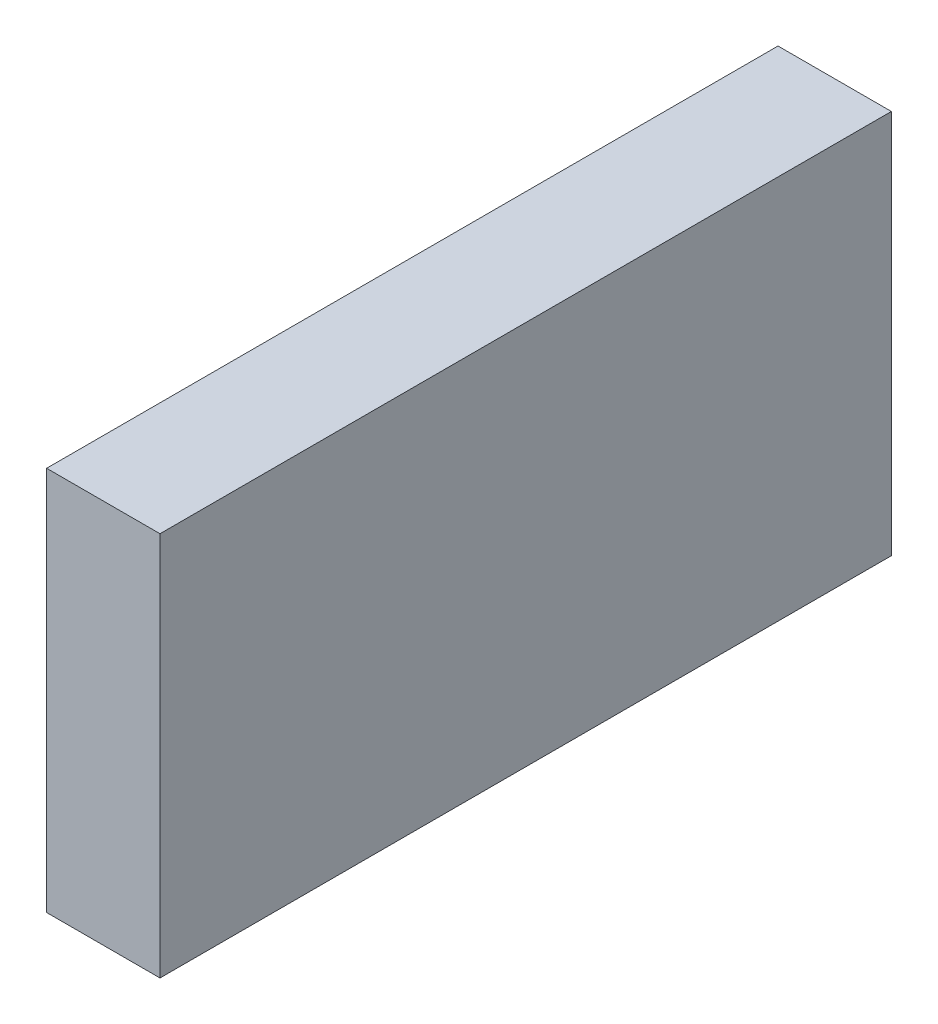
ISO-10303-21;
HEADER;
FILE_DESCRIPTION(('STEP AP214'),'2;1');
FILE_NAME('part.step','',(''),(''),'','','');
FILE_SCHEMA(('AUTOMOTIVE_DESIGN { 1 0 10303 214 1 1 1 1 }'));
ENDSEC;
DATA;
#1=APPLICATION_CONTEXT('core data for automotive mechanical design processes');
#2=APPLICATION_PROTOCOL_DEFINITION('international standard','automotive_design',2000,#1);
#3=PRODUCT_CONTEXT('',#1,'mechanical');
#4=PRODUCT('Part','Part','',(#3));
#5=PRODUCT_RELATED_PRODUCT_CATEGORY('part','',(#4));
#6=PRODUCT_DEFINITION_FORMATION('','',#4);
#7=PRODUCT_DEFINITION_CONTEXT('part definition',#1,'design');
#8=PRODUCT_DEFINITION('design','',#6,#7);
#9=PRODUCT_DEFINITION_SHAPE('','',#8);
#10=(LENGTH_UNIT() NAMED_UNIT(*) SI_UNIT(.MILLI.,.METRE.));
#11=(NAMED_UNIT(*) PLANE_ANGLE_UNIT() SI_UNIT($,.RADIAN.));
#12=(NAMED_UNIT(*) SI_UNIT($,.STERADIAN.) SOLID_ANGLE_UNIT());
#13=UNCERTAINTY_MEASURE_WITH_UNIT(LENGTH_MEASURE(1.E-05),#10,'distance_accuracy_value','');
#14=(GEOMETRIC_REPRESENTATION_CONTEXT(3) GLOBAL_UNCERTAINTY_ASSIGNED_CONTEXT((#13)) GLOBAL_UNIT_ASSIGNED_CONTEXT((#10,
#11,#12)) REPRESENTATION_CONTEXT('',''));
#15=CARTESIAN_POINT('',(0.,0.,0.));
#16=DIRECTION('',(0.,0.,1.));
#17=DIRECTION('',(1.,0.,0.));
#18=AXIS2_PLACEMENT_3D('',#15,#16,#17);
#19=CARTESIAN_POINT('',(140.338429329019,10.,-75.2974570796293));
#20=DIRECTION('',(0.,0.,1.));
#21=DIRECTION('',(1.,0.,0.));
#22=AXIS2_PLACEMENT_3D('',#19,#20,#21);
#23=PLANE('',#22);
#24=DIRECTION('',(-1.,0.,0.));
#25=VECTOR('',#24,1.);
#26=CARTESIAN_POINT('',(140.338429329019,0.,-75.2974570796293));
#27=LINE('',#26,#25);
#28=CARTESIAN_POINT('',(140.338429329019,0.,-75.2974570796293));
#29=VERTEX_POINT('',#28);
#30=CARTESIAN_POINT('',(137.391912192511,0.,-75.2974570796293));
#31=VERTEX_POINT('',#30);
#32=EDGE_CURVE('E93',#29,#31,#27,.T.);
#33=ORIENTED_EDGE('',*,*,#32,.T.);
#34=DIRECTION('',(0.,-1.,0.));
#35=VECTOR('',#34,1.);
#36=CARTESIAN_POINT('',(137.391912192511,10.,-75.2974570796293));
#37=LINE('',#36,#35);
#38=CARTESIAN_POINT('',(137.391912192511,10.,-75.2974570796293));
#39=VERTEX_POINT('',#38);
#40=EDGE_CURVE('E11',#39,#31,#37,.T.);
#41=ORIENTED_EDGE('',*,*,#40,.F.);
#42=DIRECTION('',(-1.,0.,0.));
#43=VECTOR('',#42,1.);
#44=CARTESIAN_POINT('',(140.338429329019,10.,-75.2974570796293));
#45=LINE('',#44,#43);
#46=CARTESIAN_POINT('',(140.338429329019,10.,-75.2974570796293));
#47=VERTEX_POINT('',#46);
#48=EDGE_CURVE('E81',#47,#39,#45,.T.);
#49=ORIENTED_EDGE('',*,*,#48,.F.);
#50=DIRECTION('',(0.,-1.,0.));
#51=VECTOR('',#50,1.);
#52=CARTESIAN_POINT('',(140.338429329019,10.,-75.2974570796293));
#53=LINE('',#52,#51);
#54=EDGE_CURVE('E89',#47,#29,#53,.T.);
#55=ORIENTED_EDGE('',*,*,#54,.T.);
#56=EDGE_LOOP('',(#33,#41,#49,#55));
#57=FACE_BOUND('',#56,.T.);
#58=ADVANCED_FACE('F30',(#57),#23,.F.);
#59=CARTESIAN_POINT('',(137.391912192511,10.,-75.2974570796293));
#60=DIRECTION('',(1.,0.,0.));
#61=DIRECTION('',(0.,0.,-1.));
#62=AXIS2_PLACEMENT_3D('',#59,#60,#61);
#63=PLANE('',#62);
#64=DIRECTION('',(0.,0.,1.));
#65=VECTOR('',#64,1.);
#66=CARTESIAN_POINT('',(137.391912192511,0.,-75.2974570796293));
#67=LINE('',#66,#65);
#68=CARTESIAN_POINT('',(137.391912192511,0.,-56.28859622837));
#69=VERTEX_POINT('',#68);
#70=EDGE_CURVE('E85',#31,#69,#67,.T.);
#71=ORIENTED_EDGE('',*,*,#70,.T.);
#72=DIRECTION('',(0.,-1.,0.));
#73=VECTOR('',#72,1.);
#74=CARTESIAN_POINT('',(137.391912192511,10.,-56.28859622837));
#75=LINE('',#74,#73);
#76=CARTESIAN_POINT('',(137.391912192511,10.,-56.28859622837));
#77=VERTEX_POINT('',#76);
#78=EDGE_CURVE('E38',#77,#69,#75,.T.);
#79=ORIENTED_EDGE('',*,*,#78,.F.);
#80=DIRECTION('',(0.,0.,1.));
#81=VECTOR('',#80,1.);
#82=CARTESIAN_POINT('',(137.391912192511,10.,-75.2974570796293));
#83=LINE('',#82,#81);
#84=EDGE_CURVE('E76',#39,#77,#83,.T.);
#85=ORIENTED_EDGE('',*,*,#84,.F.);
#86=ORIENTED_EDGE('',*,*,#40,.T.);
#87=EDGE_LOOP('',(#71,#79,#85,#86));
#88=FACE_BOUND('',#87,.T.);
#89=ADVANCED_FACE('F84',(#88),#63,.F.);
#90=CARTESIAN_POINT('',(137.391912192511,10.,-56.28859622837));
#91=DIRECTION('',(0.,0.,-1.));
#92=DIRECTION('',(-1.,0.,0.));
#93=AXIS2_PLACEMENT_3D('',#90,#91,#92);
#94=PLANE('',#93);
#95=DIRECTION('',(1.,0.,0.));
#96=VECTOR('',#95,1.);
#97=CARTESIAN_POINT('',(137.391912192511,0.,-56.28859622837));
#98=LINE('',#97,#96);
#99=CARTESIAN_POINT('',(140.338429329019,0.,-56.28859622837));
#100=VERTEX_POINT('',#99);
#101=EDGE_CURVE('E63',#69,#100,#98,.T.);
#102=ORIENTED_EDGE('',*,*,#101,.T.);
#103=DIRECTION('',(0.,-1.,0.));
#104=VECTOR('',#103,1.);
#105=CARTESIAN_POINT('',(140.338429329019,10.,-56.28859622837));
#106=LINE('',#105,#104);
#107=CARTESIAN_POINT('',(140.338429329019,10.,-56.28859622837));
#108=VERTEX_POINT('',#107);
#109=EDGE_CURVE('E86',#108,#100,#106,.T.);
#110=ORIENTED_EDGE('',*,*,#109,.F.);
#111=DIRECTION('',(1.,0.,0.));
#112=VECTOR('',#111,1.);
#113=CARTESIAN_POINT('',(137.391912192511,10.,-56.28859622837));
#114=LINE('',#113,#112);
#115=EDGE_CURVE('E79',#77,#108,#114,.T.);
#116=ORIENTED_EDGE('',*,*,#115,.F.);
#117=ORIENTED_EDGE('',*,*,#78,.T.);
#118=EDGE_LOOP('',(#102,#110,#116,#117));
#119=FACE_BOUND('',#118,.T.);
#120=ADVANCED_FACE('F87',(#119),#94,.F.);
#121=CARTESIAN_POINT('',(140.338429329019,10.,-56.28859622837));
#122=DIRECTION('',(-1.,0.,0.));
#123=DIRECTION('',(0.,0.,1.));
#124=AXIS2_PLACEMENT_3D('',#121,#122,#123);
#125=PLANE('',#124);
#126=DIRECTION('',(0.,0.,-1.));
#127=VECTOR('',#126,1.);
#128=CARTESIAN_POINT('',(140.338429329019,0.,-56.28859622837));
#129=LINE('',#128,#127);
#130=EDGE_CURVE('E69',#100,#29,#129,.T.);
#131=ORIENTED_EDGE('',*,*,#130,.T.);
#132=ORIENTED_EDGE('',*,*,#54,.F.);
#133=DIRECTION('',(0.,0.,-1.));
#134=VECTOR('',#133,1.);
#135=CARTESIAN_POINT('',(140.338429329019,10.,-56.28859622837));
#136=LINE('',#135,#134);
#137=EDGE_CURVE('E46',#108,#47,#136,.T.);
#138=ORIENTED_EDGE('',*,*,#137,.F.);
#139=ORIENTED_EDGE('',*,*,#109,.T.);
#140=EDGE_LOOP('',(#131,#132,#138,#139));
#141=FACE_BOUND('',#140,.T.);
#142=ADVANCED_FACE('F100',(#141),#125,.F.);
#143=CARTESIAN_POINT('',(0.,10.,0.));
#144=DIRECTION('',(0.,1.,0.));
#145=DIRECTION('',(0.,0.,1.));
#146=AXIS2_PLACEMENT_3D('',#143,#144,#145);
#147=PLANE('',#146);
#148=ORIENTED_EDGE('',*,*,#48,.T.);
#149=ORIENTED_EDGE('',*,*,#84,.T.);
#150=ORIENTED_EDGE('',*,*,#115,.T.);
#151=ORIENTED_EDGE('',*,*,#137,.T.);
#152=EDGE_LOOP('',(#148,#149,#150,#151));
#153=FACE_BOUND('',#152,.T.);
#154=ADVANCED_FACE('F77',(#153),#147,.T.);
#155=CARTESIAN_POINT('',(0.,0.,0.));
#156=DIRECTION('',(0.,1.,0.));
#157=DIRECTION('',(0.,0.,1.));
#158=AXIS2_PLACEMENT_3D('',#155,#156,#157);
#159=PLANE('',#158);
#160=ORIENTED_EDGE('',*,*,#32,.F.);
#161=ORIENTED_EDGE('',*,*,#130,.F.);
#162=ORIENTED_EDGE('',*,*,#101,.F.);
#163=ORIENTED_EDGE('',*,*,#70,.F.);
#164=EDGE_LOOP('',(#160,#161,#162,#163));
#165=FACE_BOUND('',#164,.T.);
#166=ADVANCED_FACE('F103',(#165),#159,.F.);
#167=CLOSED_SHELL('',(#58,#89,#120,#142,#154,#166));
#168=MANIFOLD_SOLID_BREP('B2',#167);
#169=ADVANCED_BREP_SHAPE_REPRESENTATION('',(#18,#168),#14);
#170=SHAPE_DEFINITION_REPRESENTATION(#9,#169);
ENDSEC;
END-ISO-10303-21;
